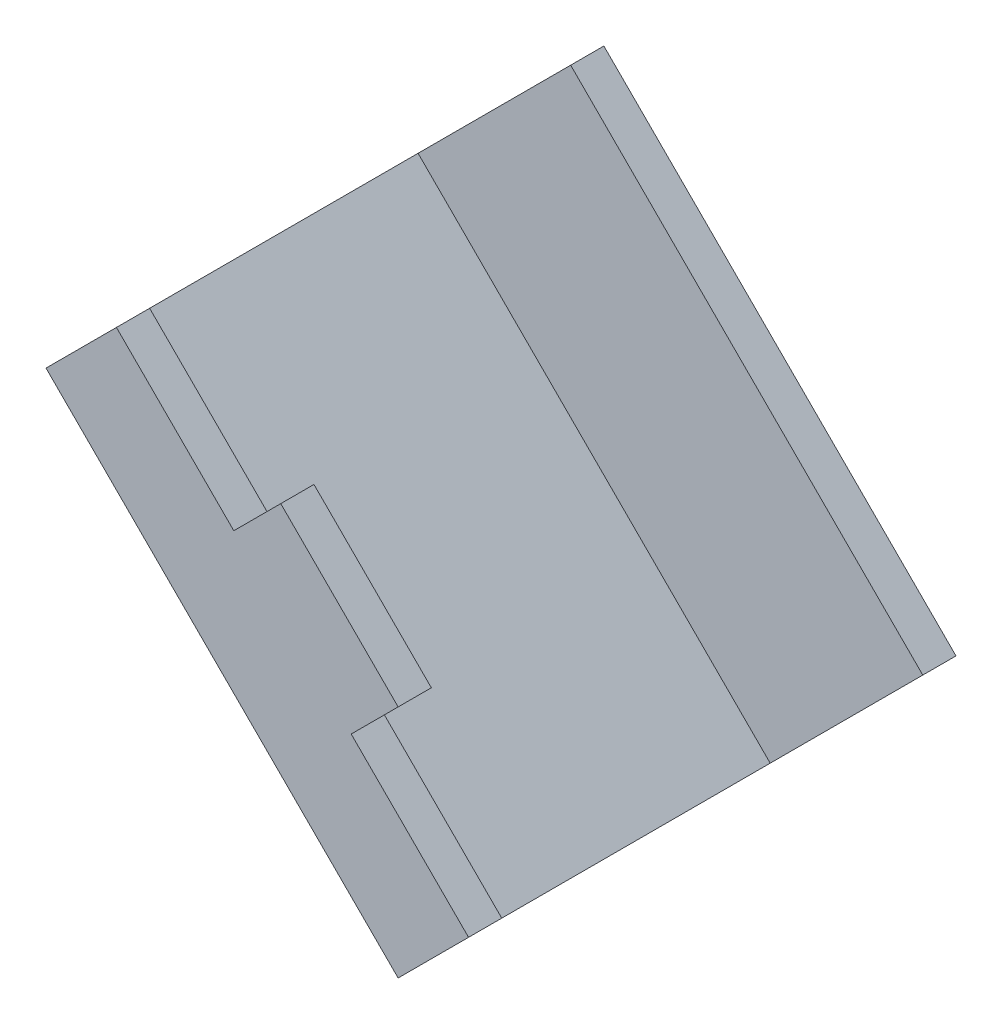
ISO-10303-21;
HEADER;
FILE_DESCRIPTION(('STEP AP214'),'2;1');
FILE_NAME('part.step','',(''),(''),'','','');
FILE_SCHEMA(('AUTOMOTIVE_DESIGN { 1 0 10303 214 1 1 1 1 }'));
ENDSEC;
DATA;
#1=APPLICATION_CONTEXT('core data for automotive mechanical design processes');
#2=APPLICATION_PROTOCOL_DEFINITION('international standard','automotive_design',2000,#1);
#3=PRODUCT_CONTEXT('',#1,'mechanical');
#4=PRODUCT('Part','Part','',(#3));
#5=PRODUCT_RELATED_PRODUCT_CATEGORY('part','',(#4));
#6=PRODUCT_DEFINITION_FORMATION('','',#4);
#7=PRODUCT_DEFINITION_CONTEXT('part definition',#1,'design');
#8=PRODUCT_DEFINITION('design','',#6,#7);
#9=PRODUCT_DEFINITION_SHAPE('','',#8);
#10=(LENGTH_UNIT() NAMED_UNIT(*) SI_UNIT(.MILLI.,.METRE.));
#11=(NAMED_UNIT(*) PLANE_ANGLE_UNIT() SI_UNIT($,.RADIAN.));
#12=(NAMED_UNIT(*) SI_UNIT($,.STERADIAN.) SOLID_ANGLE_UNIT());
#13=UNCERTAINTY_MEASURE_WITH_UNIT(LENGTH_MEASURE(1.E-05),#10,'distance_accuracy_value','');
#14=(GEOMETRIC_REPRESENTATION_CONTEXT(3) GLOBAL_UNCERTAINTY_ASSIGNED_CONTEXT((#13)) GLOBAL_UNIT_ASSIGNED_CONTEXT((#10,
#11,#12)) REPRESENTATION_CONTEXT('',''));
#15=CARTESIAN_POINT('',(0.,0.,0.));
#16=DIRECTION('',(0.,0.,1.));
#17=DIRECTION('',(1.,0.,0.));
#18=AXIS2_PLACEMENT_3D('',#15,#16,#17);
#19=CARTESIAN_POINT('',(7.809240996835,8.1457792057,1.00916));
#20=DIRECTION('',(0.,0.,-1.));
#21=DIRECTION('',(-1.,0.,0.));
#22=AXIS2_PLACEMENT_3D('',#19,#20,#21);
#23=PLANE('',#22);
#24=DIRECTION('',(-0.707106781186548,0.707106781186548,0.));
#25=VECTOR('',#24,1.);
#26=CARTESIAN_POINT('',(7.809240996835,8.1457792057,1.00916));
#27=LINE('',#26,#25);
#28=CARTESIAN_POINT('',(7.40294408408988,8.55207611844587,1.00916));
#29=VERTEX_POINT('',#28);
#30=CARTESIAN_POINT('',(7.61507611844587,8.33994408408988,1.00916));
#31=VERTEX_POINT('',#30);
#32=EDGE_CURVE('E123',#29,#31,#27,.F.);
#33=ORIENTED_EDGE('',*,*,#32,.F.);
#34=DIRECTION('',(0.707106781186548,0.707106781186548,0.));
#35=VECTOR('',#34,1.);
#36=CARTESIAN_POINT('',(7.40294408409,8.552076118446,1.00916));
#37=LINE('',#36,#35);
#38=CARTESIAN_POINT('',(7.431228355337,8.580360389693,1.00916));
#39=VERTEX_POINT('',#38);
#40=EDGE_CURVE('E111',#29,#39,#37,.T.);
#41=ORIENTED_EDGE('',*,*,#40,.T.);
#42=DIRECTION('',(0.707106781186548,-0.707106781186548,0.));
#43=VECTOR('',#42,1.);
#44=CARTESIAN_POINT('',(7.431228355337,8.580360389693,1.00916));
#45=LINE('',#44,#43);
#46=CARTESIAN_POINT('',(7.50193903345575,8.50964971157475,1.00916));
#47=VERTEX_POINT('',#46);
#48=EDGE_CURVE('E117',#39,#47,#45,.T.);
#49=ORIENTED_EDGE('',*,*,#48,.T.);
#50=DIRECTION('',(0.707106781186548,0.707106781186548,0.));
#51=VECTOR('',#50,1.);
#52=CARTESIAN_POINT('',(7.501939033456,8.509649711575,1.00916));
#53=LINE('',#52,#51);
#54=CARTESIAN_POINT('',(7.530223304703,8.537933982822,1.00916));
#55=VERTEX_POINT('',#54);
#56=EDGE_CURVE('E144',#47,#55,#53,.T.);
#57=ORIENTED_EDGE('',*,*,#56,.T.);
#58=DIRECTION('',(-0.707106781186548,0.707106781186548,0.));
#59=VECTOR('',#58,1.);
#60=CARTESIAN_POINT('',(7.86580953933,8.202347748195,1.00916));
#61=LINE('',#60,#59);
#62=CARTESIAN_POINT('',(7.600933982822,8.467223304703,1.00916));
#63=VERTEX_POINT('',#62);
#64=EDGE_CURVE('E139',#63,#55,#61,.T.);
#65=ORIENTED_EDGE('',*,*,#64,.F.);
#66=DIRECTION('',(-0.707106781186548,-0.707106781186548,0.));
#67=VECTOR('',#66,1.);
#68=CARTESIAN_POINT('',(7.572649711575,8.438939033456,1.00916));
#69=LINE('',#68,#67);
#70=CARTESIAN_POINT('',(7.57264971157475,8.43893903345575,1.00916));
#71=VERTEX_POINT('',#70);
#72=EDGE_CURVE('E134',#63,#71,#69,.T.);
#73=ORIENTED_EDGE('',*,*,#72,.T.);
#74=DIRECTION('',(0.707106781186548,-0.707106781186548,0.));
#75=VECTOR('',#74,1.);
#76=CARTESIAN_POINT('',(7.643360389693,8.368228355337,1.00916));
#77=LINE('',#76,#75);
#78=CARTESIAN_POINT('',(7.643360389693,8.368228355337,1.00916));
#79=VERTEX_POINT('',#78);
#80=EDGE_CURVE('E103',#71,#79,#77,.T.);
#81=ORIENTED_EDGE('',*,*,#80,.T.);
#82=DIRECTION('',(-0.707106781186569,-0.707106781186526,0.));
#83=VECTOR('',#82,1.);
#84=CARTESIAN_POINT('',(7.643360389693,8.368228355337,1.00916));
#85=LINE('',#84,#83);
#86=EDGE_CURVE('E20',#79,#31,#85,.T.);
#87=ORIENTED_EDGE('',*,*,#86,.T.);
#88=EDGE_LOOP('',(#33,#41,#49,#57,#65,#73,#81,#87));
#89=FACE_BOUND('',#88,.T.);
#90=ADVANCED_FACE('F17',(#89),#23,.T.);
#91=CARTESIAN_POINT('',(7.431228355337,8.580360389693,0.901456703857));
#92=DIRECTION('',(-0.707106781186548,-0.707106781186548,0.));
#93=DIRECTION('',(0.707106781186548,-0.707106781186548,0.));
#94=AXIS2_PLACEMENT_3D('',#91,#92,#93);
#95=PLANE('',#94);
#96=DIRECTION('',(0.,0.,1.));
#97=VECTOR('',#96,1.);
#98=CARTESIAN_POINT('',(7.431228355337,8.580360389693,0.901456703857));
#99=LINE('',#98,#97);
#100=CARTESIAN_POINT('',(7.431228355337,8.580360389693,1.02916));
#101=VERTEX_POINT('',#100);
#102=EDGE_CURVE('E107',#101,#39,#99,.F.);
#103=ORIENTED_EDGE('',*,*,#102,.F.);
#104=DIRECTION('',(-0.707106781191544,0.707106781181552,0.));
#105=VECTOR('',#104,1.);
#106=CARTESIAN_POINT('',(7.501939033456,8.509649711575,1.02916));
#107=LINE('',#106,#105);
#108=CARTESIAN_POINT('',(7.50193903345575,8.50964971157475,1.02916));
#109=VERTEX_POINT('',#108);
#110=EDGE_CURVE('E161',#109,#101,#107,.T.);
#111=ORIENTED_EDGE('',*,*,#110,.F.);
#112=DIRECTION('',(0.,0.,1.));
#113=VECTOR('',#112,1.);
#114=CARTESIAN_POINT('',(7.501939033456,8.509649711575,0.901456703857));
#115=LINE('',#114,#113);
#116=EDGE_CURVE('E127',#109,#47,#115,.F.);
#117=ORIENTED_EDGE('',*,*,#116,.T.);
#118=ORIENTED_EDGE('',*,*,#48,.F.);
#119=EDGE_LOOP('',(#103,#111,#117,#118));
#120=FACE_BOUND('',#119,.T.);
#121=ADVANCED_FACE('F125',(#120),#95,.F.);
#122=CARTESIAN_POINT('',(7.643360389693,8.368228355337,0.901456703857));
#123=DIRECTION('',(-0.707106781186548,-0.707106781186548,0.));
#124=DIRECTION('',(0.707106781186548,-0.707106781186548,0.));
#125=AXIS2_PLACEMENT_3D('',#122,#123,#124);
#126=PLANE('',#125);
#127=DIRECTION('',(0.,0.,1.));
#128=VECTOR('',#127,1.);
#129=CARTESIAN_POINT('',(7.572649711575,8.438939033456,0.901456703857));
#130=LINE('',#129,#128);
#131=CARTESIAN_POINT('',(7.57264971157475,8.43893903345575,1.02916));
#132=VERTEX_POINT('',#131);
#133=EDGE_CURVE('E130',#71,#132,#130,.T.);
#134=ORIENTED_EDGE('',*,*,#133,.T.);
#135=DIRECTION('',(-0.707106781181547,0.707106781191548,0.));
#136=VECTOR('',#135,1.);
#137=CARTESIAN_POINT('',(7.643360389693,8.368228355337,1.02916));
#138=LINE('',#137,#136);
#139=CARTESIAN_POINT('',(7.643360389693,8.368228355337,1.02916));
#140=VERTEX_POINT('',#139);
#141=EDGE_CURVE('E166',#140,#132,#138,.T.);
#142=ORIENTED_EDGE('',*,*,#141,.F.);
#143=DIRECTION('',(0.,0.,1.));
#144=VECTOR('',#143,1.);
#145=CARTESIAN_POINT('',(7.643360389693,8.368228355337,1.00916));
#146=LINE('',#145,#144);
#147=EDGE_CURVE('E159',#140,#79,#146,.F.);
#148=ORIENTED_EDGE('',*,*,#147,.T.);
#149=ORIENTED_EDGE('',*,*,#80,.F.);
#150=EDGE_LOOP('',(#134,#142,#148,#149));
#151=FACE_BOUND('',#150,.T.);
#152=ADVANCED_FACE('F218',(#151),#126,.F.);
#153=CARTESIAN_POINT('',(7.572649711575,8.438939033456,0.901456703857));
#154=DIRECTION('',(-0.707106781186548,0.707106781186548,0.));
#155=DIRECTION('',(-0.707106781186548,-0.707106781186548,0.));
#156=AXIS2_PLACEMENT_3D('',#153,#154,#155);
#157=PLANE('',#156);
#158=DIRECTION('',(0.,0.,1.));
#159=VECTOR('',#158,1.);
#160=CARTESIAN_POINT('',(7.600933982822,8.467223304703,1.00916));
#161=LINE('',#160,#159);
#162=CARTESIAN_POINT('',(7.600933982822,8.467223304703,1.02916));
#163=VERTEX_POINT('',#162);
#164=EDGE_CURVE('E136',#163,#63,#161,.F.);
#165=ORIENTED_EDGE('',*,*,#164,.F.);
#166=DIRECTION('',(0.707106781186548,0.707106781186548,0.));
#167=VECTOR('',#166,1.);
#168=CARTESIAN_POINT('',(7.572649711575,8.438939033456,1.02916));
#169=LINE('',#168,#167);
#170=EDGE_CURVE('E169',#132,#163,#169,.T.);
#171=ORIENTED_EDGE('',*,*,#170,.F.);
#172=ORIENTED_EDGE('',*,*,#133,.F.);
#173=ORIENTED_EDGE('',*,*,#72,.F.);
#174=EDGE_LOOP('',(#165,#171,#172,#173));
#175=FACE_BOUND('',#174,.T.);
#176=ADVANCED_FACE('F216',(#175),#157,.F.);
#177=CARTESIAN_POINT('',(7.86580953933,8.202347748195,1.00916));
#178=DIRECTION('',(0.707106781186548,0.707106781186548,0.));
#179=DIRECTION('',(-0.707106781186548,0.707106781186548,0.));
#180=AXIS2_PLACEMENT_3D('',#177,#178,#179);
#181=PLANE('',#180);
#182=ORIENTED_EDGE('',*,*,#164,.T.);
#183=ORIENTED_EDGE('',*,*,#64,.T.);
#184=DIRECTION('',(0.,0.,1.));
#185=VECTOR('',#184,1.);
#186=CARTESIAN_POINT('',(7.530223304703,8.537933982822,0.901456703857));
#187=LINE('',#186,#185);
#188=CARTESIAN_POINT('',(7.530223304703,8.537933982822,1.02916));
#189=VERTEX_POINT('',#188);
#190=EDGE_CURVE('E141',#55,#189,#187,.T.);
#191=ORIENTED_EDGE('',*,*,#190,.T.);
#192=DIRECTION('',(-0.707106781186548,0.707106781186548,0.));
#193=VECTOR('',#192,1.);
#194=CARTESIAN_POINT('',(7.600933982822,8.467223304703,1.02916));
#195=LINE('',#194,#193);
#196=EDGE_CURVE('E172',#163,#189,#195,.T.);
#197=ORIENTED_EDGE('',*,*,#196,.F.);
#198=EDGE_LOOP('',(#182,#183,#191,#197));
#199=FACE_BOUND('',#198,.T.);
#200=ADVANCED_FACE('F213',(#199),#181,.T.);
#201=CARTESIAN_POINT('',(7.501939033456,8.509649711575,0.901456703857));
#202=DIRECTION('',(0.707106781186548,-0.707106781186548,0.));
#203=DIRECTION('',(0.707106781186548,0.707106781186548,0.));
#204=AXIS2_PLACEMENT_3D('',#201,#202,#203);
#205=PLANE('',#204);
#206=ORIENTED_EDGE('',*,*,#116,.F.);
#207=DIRECTION('',(-0.707106781186548,-0.707106781186548,0.));
#208=VECTOR('',#207,1.);
#209=CARTESIAN_POINT('',(7.530223304703,8.537933982822,1.02916));
#210=LINE('',#209,#208);
#211=EDGE_CURVE('E175',#189,#109,#210,.T.);
#212=ORIENTED_EDGE('',*,*,#211,.F.);
#213=ORIENTED_EDGE('',*,*,#190,.F.);
#214=ORIENTED_EDGE('',*,*,#56,.F.);
#215=EDGE_LOOP('',(#206,#212,#213,#214));
#216=FACE_BOUND('',#215,.T.);
#217=ADVANCED_FACE('F207',(#216),#205,.F.);
#218=CARTESIAN_POINT('',(7.809240996835,8.1457792057,0.81916));
#219=DIRECTION('',(0.707106781186548,0.707106781186548,0.));
#220=DIRECTION('',(-0.707106781186548,0.707106781186548,0.));
#221=AXIS2_PLACEMENT_3D('',#218,#219,#220);
#222=PLANE('',#221);
#223=DIRECTION('',(0.,0.,1.));
#224=VECTOR('',#223,1.);
#225=CARTESIAN_POINT('',(7.40294408409,8.552076118446,0.81916));
#226=LINE('',#225,#224);
#227=CARTESIAN_POINT('',(7.40294408408975,8.55207611844575,0.81916));
#228=VERTEX_POINT('',#227);
#229=EDGE_CURVE('E178',#29,#228,#226,.F.);
#230=ORIENTED_EDGE('',*,*,#229,.F.);
#231=ORIENTED_EDGE('',*,*,#32,.T.);
#232=DIRECTION('',(0.,0.,1.));
#233=VECTOR('',#232,1.);
#234=CARTESIAN_POINT('',(7.615076118446,8.33994408409,1.00916));
#235=LINE('',#234,#233);
#236=CARTESIAN_POINT('',(7.61507611844575,8.33994408408975,0.81916));
#237=VERTEX_POINT('',#236);
#238=EDGE_CURVE('E153',#31,#237,#235,.F.);
#239=ORIENTED_EDGE('',*,*,#238,.T.);
#240=DIRECTION('',(0.707106781186549,-0.707106781186546,0.));
#241=VECTOR('',#240,1.);
#242=CARTESIAN_POINT('',(7.40294408409,8.552076118446,0.81916));
#243=LINE('',#242,#241);
#244=EDGE_CURVE('E147',#228,#237,#243,.T.);
#245=ORIENTED_EDGE('',*,*,#244,.F.);
#246=EDGE_LOOP('',(#230,#231,#239,#245));
#247=FACE_BOUND('',#246,.T.);
#248=ADVANCED_FACE('F224',(#247),#222,.T.);
#249=CARTESIAN_POINT('',(7.901164878389,8.237703087255,0.81916));
#250=DIRECTION('',(0.,0.,1.));
#251=DIRECTION('',(1.,0.,0.));
#252=AXIS2_PLACEMENT_3D('',#249,#250,#251);
#253=PLANE('',#252);
#254=DIRECTION('',(-0.707106781186548,-0.707106781186548,0.));
#255=VECTOR('',#254,1.);
#256=CARTESIAN_POINT('',(7.600933982822,8.750066017178,0.81916));
#257=LINE('',#256,#255);
#258=CARTESIAN_POINT('',(7.494867965644,8.644,0.81916));
#259=VERTEX_POINT('',#258);
#260=EDGE_CURVE('E180',#228,#259,#257,.F.);
#261=ORIENTED_EDGE('',*,*,#260,.F.);
#262=ORIENTED_EDGE('',*,*,#244,.T.);
#263=DIRECTION('',(-0.707106781186548,-0.707106781186548,0.));
#264=VECTOR('',#263,1.);
#265=CARTESIAN_POINT('',(7.615076118446,8.33994408409,0.81916));
#266=LINE('',#265,#264);
#267=CARTESIAN_POINT('',(7.707,8.431867965644,0.81916));
#268=VERTEX_POINT('',#267);
#269=EDGE_CURVE('E155',#237,#268,#266,.F.);
#270=ORIENTED_EDGE('',*,*,#269,.T.);
#271=DIRECTION('',(-0.707106781186548,0.707106781186548,0.));
#272=VECTOR('',#271,1.);
#273=CARTESIAN_POINT('',(7.901164878389,8.237703087255,0.81916));
#274=LINE('',#273,#272);
#275=EDGE_CURVE('E150',#259,#268,#274,.F.);
#276=ORIENTED_EDGE('',*,*,#275,.F.);
#277=EDGE_LOOP('',(#261,#262,#270,#276));
#278=FACE_BOUND('',#277,.T.);
#279=ADVANCED_FACE('F229',(#278),#253,.T.);
#280=CARTESIAN_POINT('',(7.901164878389,8.237703087255,0.79916));
#281=DIRECTION('',(0.707106781186548,0.707106781186548,0.));
#282=DIRECTION('',(-0.707106781186548,0.707106781186548,0.));
#283=AXIS2_PLACEMENT_3D('',#280,#281,#282);
#284=PLANE('',#283);
#285=DIRECTION('',(0.,0.,1.));
#286=VECTOR('',#285,1.);
#287=CARTESIAN_POINT('',(7.494867965644,8.644,0.81916));
#288=LINE('',#287,#286);
#289=CARTESIAN_POINT('',(7.494867965644,8.644,0.79916));
#290=VERTEX_POINT('',#289);
#291=EDGE_CURVE('E183',#259,#290,#288,.F.);
#292=ORIENTED_EDGE('',*,*,#291,.F.);
#293=ORIENTED_EDGE('',*,*,#275,.T.);
#294=DIRECTION('',(0.,0.,1.));
#295=VECTOR('',#294,1.);
#296=CARTESIAN_POINT('',(7.707,8.431867965644,1.00916));
#297=LINE('',#296,#295);
#298=CARTESIAN_POINT('',(7.707,8.431867965644,0.79916));
#299=VERTEX_POINT('',#298);
#300=EDGE_CURVE('E157',#268,#299,#297,.F.);
#301=ORIENTED_EDGE('',*,*,#300,.T.);
#302=DIRECTION('',(0.70710678118655,-0.707106781186545,0.));
#303=VECTOR('',#302,1.);
#304=CARTESIAN_POINT('',(7.494867965644,8.644,0.79916));
#305=LINE('',#304,#303);
#306=EDGE_CURVE('E190',#290,#299,#305,.T.);
#307=ORIENTED_EDGE('',*,*,#306,.F.);
#308=EDGE_LOOP('',(#292,#293,#301,#307));
#309=FACE_BOUND('',#308,.T.);
#310=ADVANCED_FACE('F232',(#309),#284,.T.);
#311=CARTESIAN_POINT('',(7.615076118446,8.33994408409,1.00916));
#312=DIRECTION('',(-0.707106781186548,0.707106781186548,0.));
#313=DIRECTION('',(-0.707106781186548,-0.707106781186548,0.));
#314=AXIS2_PLACEMENT_3D('',#311,#312,#313);
#315=PLANE('',#314);
#316=ORIENTED_EDGE('',*,*,#147,.F.);
#317=DIRECTION('',(0.70710678118654,0.707106781186555,0.));
#318=VECTOR('',#317,1.);
#319=CARTESIAN_POINT('',(7.600933982822,8.325801948466,1.02916));
#320=LINE('',#319,#318);
#321=CARTESIAN_POINT('',(7.600933982822,8.325801948466,1.02916));
#322=VERTEX_POINT('',#321);
#323=EDGE_CURVE('E163',#322,#140,#320,.T.);
#324=ORIENTED_EDGE('',*,*,#323,.F.);
#325=DIRECTION('',(0.,0.,1.));
#326=VECTOR('',#325,1.);
#327=CARTESIAN_POINT('',(7.600933982822,8.325801948466,1.02916));
#328=LINE('',#327,#326);
#329=CARTESIAN_POINT('',(7.600933982822,8.325801948466,0.79916));
#330=VERTEX_POINT('',#329);
#331=EDGE_CURVE('E193',#330,#322,#328,.T.);
#332=ORIENTED_EDGE('',*,*,#331,.F.);
#333=DIRECTION('',(-0.707106781186539,-0.707106781186556,0.));
#334=VECTOR('',#333,1.);
#335=CARTESIAN_POINT('',(7.707,8.431867965644,0.79916));
#336=LINE('',#335,#334);
#337=EDGE_CURVE('E186',#299,#330,#336,.T.);
#338=ORIENTED_EDGE('',*,*,#337,.F.);
#339=ORIENTED_EDGE('',*,*,#300,.F.);
#340=ORIENTED_EDGE('',*,*,#269,.F.);
#341=ORIENTED_EDGE('',*,*,#238,.F.);
#342=ORIENTED_EDGE('',*,*,#86,.F.);
#343=EDGE_LOOP('',(#316,#324,#332,#338,#339,#340,#341,#342));
#344=FACE_BOUND('',#343,.T.);
#345=ADVANCED_FACE('F220',(#344),#315,.F.);
#346=CARTESIAN_POINT('',(7.86580953933,8.202347748195,1.02916));
#347=DIRECTION('',(0.,0.,1.));
#348=DIRECTION('',(1.,0.,0.));
#349=AXIS2_PLACEMENT_3D('',#346,#347,#348);
#350=PLANE('',#349);
#351=ORIENTED_EDGE('',*,*,#196,.T.);
#352=ORIENTED_EDGE('',*,*,#211,.T.);
#353=ORIENTED_EDGE('',*,*,#110,.T.);
#354=DIRECTION('',(-0.707106781186548,-0.707106781186548,0.));
#355=VECTOR('',#354,1.);
#356=CARTESIAN_POINT('',(7.600933982822,8.750066017178,1.02916));
#357=LINE('',#356,#355);
#358=CARTESIAN_POINT('',(7.388801948466,8.537933982822,1.02916));
#359=VERTEX_POINT('',#358);
#360=EDGE_CURVE('E113',#359,#101,#357,.F.);
#361=ORIENTED_EDGE('',*,*,#360,.F.);
#362=DIRECTION('',(0.707106781186548,-0.707106781186548,0.));
#363=VECTOR('',#362,1.);
#364=CARTESIAN_POINT('',(7.795098861211,8.131637070077,1.02916));
#365=LINE('',#364,#363);
#366=EDGE_CURVE('E196',#322,#359,#365,.F.);
#367=ORIENTED_EDGE('',*,*,#366,.F.);
#368=ORIENTED_EDGE('',*,*,#323,.T.);
#369=ORIENTED_EDGE('',*,*,#141,.T.);
#370=ORIENTED_EDGE('',*,*,#170,.T.);
#371=EDGE_LOOP('',(#351,#352,#353,#361,#367,#368,#369,#370));
#372=FACE_BOUND('',#371,.T.);
#373=ADVANCED_FACE('F204',(#372),#350,.T.);
#374=CARTESIAN_POINT('',(7.600933982822,8.750066017178,0.81916));
#375=DIRECTION('',(-0.707106781186548,0.707106781186548,0.));
#376=DIRECTION('',(-0.707106781186548,-0.707106781186548,0.));
#377=AXIS2_PLACEMENT_3D('',#374,#375,#376);
#378=PLANE('',#377);
#379=DIRECTION('',(0.,0.,1.));
#380=VECTOR('',#379,1.);
#381=CARTESIAN_POINT('',(7.388801948466,8.537933982822,1.02916));
#382=LINE('',#381,#380);
#383=CARTESIAN_POINT('',(7.388801948466,8.537933982822,0.79916));
#384=VERTEX_POINT('',#383);
#385=EDGE_CURVE('E26',#359,#384,#382,.F.);
#386=ORIENTED_EDGE('',*,*,#385,.F.);
#387=ORIENTED_EDGE('',*,*,#360,.T.);
#388=ORIENTED_EDGE('',*,*,#102,.T.);
#389=ORIENTED_EDGE('',*,*,#40,.F.);
#390=ORIENTED_EDGE('',*,*,#229,.T.);
#391=ORIENTED_EDGE('',*,*,#260,.T.);
#392=ORIENTED_EDGE('',*,*,#291,.T.);
#393=DIRECTION('',(0.707106781186545,0.70710678118655,0.));
#394=VECTOR('',#393,1.);
#395=CARTESIAN_POINT('',(7.388801948466,8.537933982822,0.79916));
#396=LINE('',#395,#394);
#397=EDGE_CURVE('E35',#384,#290,#396,.T.);
#398=ORIENTED_EDGE('',*,*,#397,.F.);
#399=EDGE_LOOP('',(#386,#387,#388,#389,#390,#391,#392,#398));
#400=FACE_BOUND('',#399,.T.);
#401=ADVANCED_FACE('F109',(#400),#378,.T.);
#402=CARTESIAN_POINT('',(7.795098861211,8.131637070077,0.79916));
#403=DIRECTION('',(0.,0.,-1.));
#404=DIRECTION('',(-1.,0.,0.));
#405=AXIS2_PLACEMENT_3D('',#402,#403,#404);
#406=PLANE('',#405);
#407=ORIENTED_EDGE('',*,*,#397,.T.);
#408=ORIENTED_EDGE('',*,*,#306,.T.);
#409=ORIENTED_EDGE('',*,*,#337,.T.);
#410=DIRECTION('',(0.707106781186548,-0.707106781186548,0.));
#411=VECTOR('',#410,1.);
#412=CARTESIAN_POINT('',(7.795098861211,8.131637070077,0.79916));
#413=LINE('',#412,#411);
#414=EDGE_CURVE('E11',#384,#330,#413,.T.);
#415=ORIENTED_EDGE('',*,*,#414,.F.);
#416=EDGE_LOOP('',(#407,#408,#409,#415));
#417=FACE_BOUND('',#416,.T.);
#418=ADVANCED_FACE('F235',(#417),#406,.T.);
#419=CARTESIAN_POINT('',(7.795098861211,8.131637070077,1.02916));
#420=DIRECTION('',(-0.707106781186548,-0.707106781186548,0.));
#421=DIRECTION('',(0.707106781186548,-0.707106781186548,0.));
#422=AXIS2_PLACEMENT_3D('',#419,#420,#421);
#423=PLANE('',#422);
#424=ORIENTED_EDGE('',*,*,#385,.T.);
#425=ORIENTED_EDGE('',*,*,#414,.T.);
#426=ORIENTED_EDGE('',*,*,#331,.T.);
#427=ORIENTED_EDGE('',*,*,#366,.T.);
#428=EDGE_LOOP('',(#424,#425,#426,#427));
#429=FACE_BOUND('',#428,.T.);
#430=ADVANCED_FACE('F201',(#429),#423,.T.);
#431=CLOSED_SHELL('',(#90,#121,#152,#176,#200,#217,#248,#279,#310,#345,#373,#401,#418,#430));
#432=MANIFOLD_SOLID_BREP('B1',#431);
#433=ADVANCED_BREP_SHAPE_REPRESENTATION('',(#18,#432),#14);
#434=SHAPE_DEFINITION_REPRESENTATION(#9,#433);
ENDSEC;
END-ISO-10303-21;
